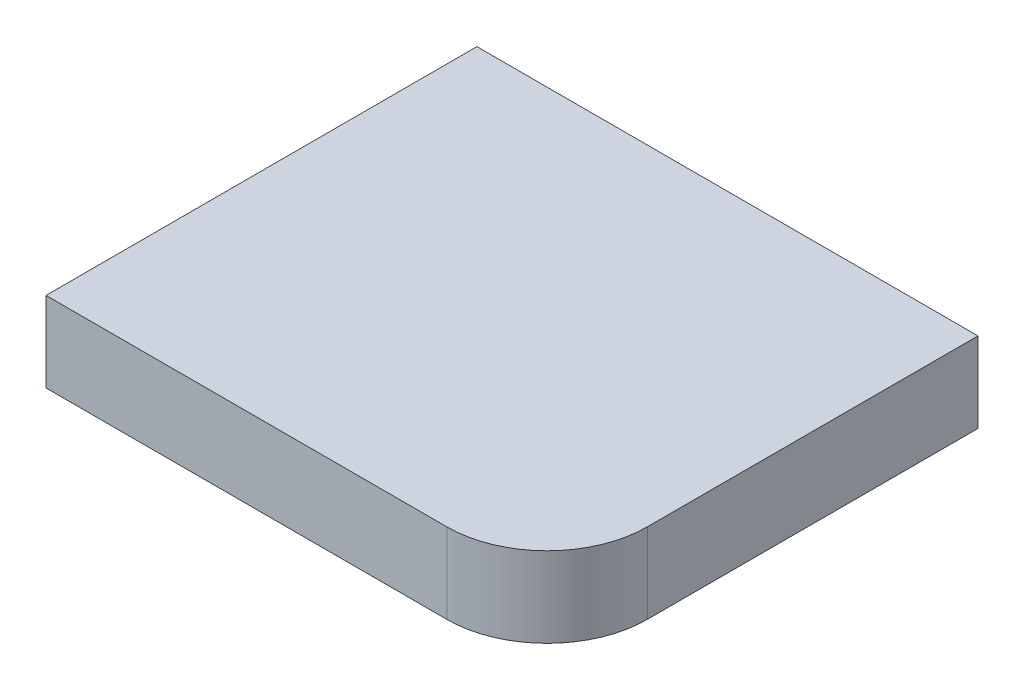
ISO-10303-21;
HEADER;
FILE_DESCRIPTION(('STEP AP214'),'2;1');
FILE_NAME('part.step','',(''),(''),'','','');
FILE_SCHEMA(('AUTOMOTIVE_DESIGN { 1 0 10303 214 1 1 1 1 }'));
ENDSEC;
DATA;
#1=APPLICATION_CONTEXT('core data for automotive mechanical design processes');
#2=APPLICATION_PROTOCOL_DEFINITION('international standard','automotive_design',2000,#1);
#3=PRODUCT_CONTEXT('',#1,'mechanical');
#4=PRODUCT('Part','Part','',(#3));
#5=PRODUCT_RELATED_PRODUCT_CATEGORY('part','',(#4));
#6=PRODUCT_DEFINITION_FORMATION('','',#4);
#7=PRODUCT_DEFINITION_CONTEXT('part definition',#1,'design');
#8=PRODUCT_DEFINITION('design','',#6,#7);
#9=PRODUCT_DEFINITION_SHAPE('','',#8);
#10=(LENGTH_UNIT() NAMED_UNIT(*) SI_UNIT(.MILLI.,.METRE.));
#11=(NAMED_UNIT(*) PLANE_ANGLE_UNIT() SI_UNIT($,.RADIAN.));
#12=(NAMED_UNIT(*) SI_UNIT($,.STERADIAN.) SOLID_ANGLE_UNIT());
#13=UNCERTAINTY_MEASURE_WITH_UNIT(LENGTH_MEASURE(1.E-05),#10,'distance_accuracy_value','');
#14=(GEOMETRIC_REPRESENTATION_CONTEXT(3) GLOBAL_UNCERTAINTY_ASSIGNED_CONTEXT((#13)) GLOBAL_UNIT_ASSIGNED_CONTEXT((#10,
#11,#12)) REPRESENTATION_CONTEXT('',''));
#15=CARTESIAN_POINT('',(0.,0.,0.));
#16=DIRECTION('',(0.,0.,1.));
#17=DIRECTION('',(1.,0.,0.));
#18=AXIS2_PLACEMENT_3D('',#15,#16,#17);
#19=CARTESIAN_POINT('',(25.,8.,11.5));
#20=DIRECTION('',(-1.,0.,0.));
#21=DIRECTION('',(0.,0.,1.));
#22=AXIS2_PLACEMENT_3D('',#19,#20,#21);
#23=PLANE('',#22);
#24=DIRECTION('',(0.,0.,-1.));
#25=VECTOR('',#24,1.);
#26=CARTESIAN_POINT('',(25.,0.,11.5));
#27=LINE('',#26,#25);
#28=CARTESIAN_POINT('',(25.,0.,11.5));
#29=VERTEX_POINT('',#28);
#30=CARTESIAN_POINT('',(25.,0.,-21.5));
#31=VERTEX_POINT('',#30);
#32=EDGE_CURVE('E107',#29,#31,#27,.T.);
#33=ORIENTED_EDGE('',*,*,#32,.T.);
#34=DIRECTION('',(0.,-1.,0.));
#35=VECTOR('',#34,1.);
#36=CARTESIAN_POINT('',(25.,8.,-21.5));
#37=LINE('',#36,#35);
#38=CARTESIAN_POINT('',(25.,8.,-21.5));
#39=VERTEX_POINT('',#38);
#40=EDGE_CURVE('E11',#39,#31,#37,.T.);
#41=ORIENTED_EDGE('',*,*,#40,.F.);
#42=DIRECTION('',(0.,0.,-1.));
#43=VECTOR('',#42,1.);
#44=CARTESIAN_POINT('',(25.,8.,11.5));
#45=LINE('',#44,#43);
#46=CARTESIAN_POINT('',(25.,8.,11.5));
#47=VERTEX_POINT('',#46);
#48=EDGE_CURVE('E115',#47,#39,#45,.T.);
#49=ORIENTED_EDGE('',*,*,#48,.F.);
#50=DIRECTION('',(0.,-1.,0.));
#51=VECTOR('',#50,1.);
#52=CARTESIAN_POINT('',(25.,8.,11.5));
#53=LINE('',#52,#51);
#54=EDGE_CURVE('E103',#47,#29,#53,.T.);
#55=ORIENTED_EDGE('',*,*,#54,.T.);
#56=EDGE_LOOP('',(#33,#41,#49,#55));
#57=FACE_BOUND('',#56,.T.);
#58=ADVANCED_FACE('F33',(#57),#23,.F.);
#59=CARTESIAN_POINT('',(-25.,8.,-21.5));
#60=DIRECTION('',(0.,0.,1.));
#61=DIRECTION('',(1.,0.,0.));
#62=AXIS2_PLACEMENT_3D('',#59,#60,#61);
#63=PLANE('',#62);
#64=DIRECTION('',(-1.,0.,0.));
#65=VECTOR('',#64,1.);
#66=CARTESIAN_POINT('',(-25.,0.,-21.5));
#67=LINE('',#66,#65);
#68=CARTESIAN_POINT('',(-25.,0.,-21.5));
#69=VERTEX_POINT('',#68);
#70=EDGE_CURVE('E110',#31,#69,#67,.T.);
#71=ORIENTED_EDGE('',*,*,#70,.T.);
#72=DIRECTION('',(0.,-1.,0.));
#73=VECTOR('',#72,1.);
#74=CARTESIAN_POINT('',(-25.,8.,-21.5));
#75=LINE('',#74,#73);
#76=CARTESIAN_POINT('',(-25.,8.,-21.5));
#77=VERTEX_POINT('',#76);
#78=EDGE_CURVE('E41',#77,#69,#75,.T.);
#79=ORIENTED_EDGE('',*,*,#78,.F.);
#80=DIRECTION('',(-1.,0.,0.));
#81=VECTOR('',#80,1.);
#82=CARTESIAN_POINT('',(-25.,8.,-21.5));
#83=LINE('',#82,#81);
#84=EDGE_CURVE('E83',#39,#77,#83,.T.);
#85=ORIENTED_EDGE('',*,*,#84,.F.);
#86=ORIENTED_EDGE('',*,*,#40,.T.);
#87=EDGE_LOOP('',(#71,#79,#85,#86));
#88=FACE_BOUND('',#87,.T.);
#89=ADVANCED_FACE('F134',(#88),#63,.F.);
#90=CARTESIAN_POINT('',(-25.,8.,21.5));
#91=DIRECTION('',(1.,0.,0.));
#92=DIRECTION('',(0.,0.,-1.));
#93=AXIS2_PLACEMENT_3D('',#90,#91,#92);
#94=PLANE('',#93);
#95=DIRECTION('',(0.,0.,1.));
#96=VECTOR('',#95,1.);
#97=CARTESIAN_POINT('',(-25.,0.,21.5));
#98=LINE('',#97,#96);
#99=CARTESIAN_POINT('',(-25.,0.,21.5));
#100=VERTEX_POINT('',#99);
#101=EDGE_CURVE('E98',#69,#100,#98,.T.);
#102=ORIENTED_EDGE('',*,*,#101,.T.);
#103=DIRECTION('',(0.,-1.,0.));
#104=VECTOR('',#103,1.);
#105=CARTESIAN_POINT('',(-25.,8.,21.5));
#106=LINE('',#105,#104);
#107=CARTESIAN_POINT('',(-25.,8.,21.5));
#108=VERTEX_POINT('',#107);
#109=EDGE_CURVE('E95',#108,#100,#106,.T.);
#110=ORIENTED_EDGE('',*,*,#109,.F.);
#111=DIRECTION('',(0.,0.,1.));
#112=VECTOR('',#111,1.);
#113=CARTESIAN_POINT('',(-25.,8.,21.5));
#114=LINE('',#113,#112);
#115=EDGE_CURVE('E87',#77,#108,#114,.T.);
#116=ORIENTED_EDGE('',*,*,#115,.F.);
#117=ORIENTED_EDGE('',*,*,#78,.T.);
#118=EDGE_LOOP('',(#102,#110,#116,#117));
#119=FACE_BOUND('',#118,.T.);
#120=ADVANCED_FACE('F96',(#119),#94,.F.);
#121=CARTESIAN_POINT('',(-25.,8.,21.5));
#122=DIRECTION('',(0.,0.,-1.));
#123=DIRECTION('',(-1.,0.,0.));
#124=AXIS2_PLACEMENT_3D('',#121,#122,#123);
#125=PLANE('',#124);
#126=DIRECTION('',(1.,0.,0.));
#127=VECTOR('',#126,1.);
#128=CARTESIAN_POINT('',(-25.,0.,21.5));
#129=LINE('',#128,#127);
#130=CARTESIAN_POINT('',(15.,0.,21.5));
#131=VERTEX_POINT('',#130);
#132=EDGE_CURVE('E69',#100,#131,#129,.T.);
#133=ORIENTED_EDGE('',*,*,#132,.T.);
#134=DIRECTION('',(0.,-1.,0.));
#135=VECTOR('',#134,1.);
#136=CARTESIAN_POINT('',(15.,8.,21.5));
#137=LINE('',#136,#135);
#138=CARTESIAN_POINT('',(15.,8.,21.5));
#139=VERTEX_POINT('',#138);
#140=EDGE_CURVE('E99',#139,#131,#137,.T.);
#141=ORIENTED_EDGE('',*,*,#140,.F.);
#142=DIRECTION('',(1.,0.,0.));
#143=VECTOR('',#142,1.);
#144=CARTESIAN_POINT('',(-25.,8.,21.5));
#145=LINE('',#144,#143);
#146=EDGE_CURVE('E91',#108,#139,#145,.T.);
#147=ORIENTED_EDGE('',*,*,#146,.F.);
#148=ORIENTED_EDGE('',*,*,#109,.T.);
#149=EDGE_LOOP('',(#133,#141,#147,#148));
#150=FACE_BOUND('',#149,.T.);
#151=ADVANCED_FACE('F101',(#150),#125,.F.);
#152=CARTESIAN_POINT('',(15.,8.,11.5));
#153=DIRECTION('',(0.,-1.,0.));
#154=DIRECTION('',(0.,0.,-1.));
#155=AXIS2_PLACEMENT_3D('',#152,#153,#154);
#156=CYLINDRICAL_SURFACE('',#155,10.);
#157=CARTESIAN_POINT('',(15.,0.,11.5));
#158=DIRECTION('',(0.,1.,0.));
#159=DIRECTION('',(0.,0.,1.));
#160=AXIS2_PLACEMENT_3D('',#157,#158,#159);
#161=CIRCLE('',#160,10.);
#162=EDGE_CURVE('E75',#131,#29,#161,.T.);
#163=ORIENTED_EDGE('',*,*,#162,.T.);
#164=ORIENTED_EDGE('',*,*,#54,.F.);
#165=CARTESIAN_POINT('',(15.,8.,11.5));
#166=DIRECTION('',(0.,1.,0.));
#167=DIRECTION('',(0.,0.,1.));
#168=AXIS2_PLACEMENT_3D('',#165,#166,#167);
#169=CIRCLE('',#168,10.);
#170=EDGE_CURVE('E49',#139,#47,#169,.T.);
#171=ORIENTED_EDGE('',*,*,#170,.F.);
#172=ORIENTED_EDGE('',*,*,#140,.T.);
#173=EDGE_LOOP('',(#163,#164,#171,#172));
#174=FACE_BOUND('',#173,.T.);
#175=ADVANCED_FACE('F123',(#174),#156,.T.);
#176=CARTESIAN_POINT('',(15.,8.,11.5));
#177=DIRECTION('',(0.,1.,0.));
#178=DIRECTION('',(0.,0.,1.));
#179=AXIS2_PLACEMENT_3D('',#176,#177,#178);
#180=PLANE('',#179);
#181=ORIENTED_EDGE('',*,*,#48,.T.);
#182=ORIENTED_EDGE('',*,*,#84,.T.);
#183=ORIENTED_EDGE('',*,*,#115,.T.);
#184=ORIENTED_EDGE('',*,*,#146,.T.);
#185=ORIENTED_EDGE('',*,*,#170,.T.);
#186=EDGE_LOOP('',(#181,#182,#183,#184,#185));
#187=FACE_BOUND('',#186,.T.);
#188=ADVANCED_FACE('F89',(#187),#180,.T.);
#189=CARTESIAN_POINT('',(15.,0.,11.5));
#190=DIRECTION('',(0.,1.,0.));
#191=DIRECTION('',(0.,0.,1.));
#192=AXIS2_PLACEMENT_3D('',#189,#190,#191);
#193=PLANE('',#192);
#194=ORIENTED_EDGE('',*,*,#32,.F.);
#195=ORIENTED_EDGE('',*,*,#162,.F.);
#196=ORIENTED_EDGE('',*,*,#132,.F.);
#197=ORIENTED_EDGE('',*,*,#101,.F.);
#198=ORIENTED_EDGE('',*,*,#70,.F.);
#199=EDGE_LOOP('',(#194,#195,#196,#197,#198));
#200=FACE_BOUND('',#199,.T.);
#201=ADVANCED_FACE('F119',(#200),#193,.F.);
#202=CLOSED_SHELL('',(#58,#89,#120,#151,#175,#188,#201));
#203=MANIFOLD_SOLID_BREP('B2',#202);
#204=ADVANCED_BREP_SHAPE_REPRESENTATION('',(#18,#203),#14);
#205=SHAPE_DEFINITION_REPRESENTATION(#9,#204);
ENDSEC;
END-ISO-10303-21;
